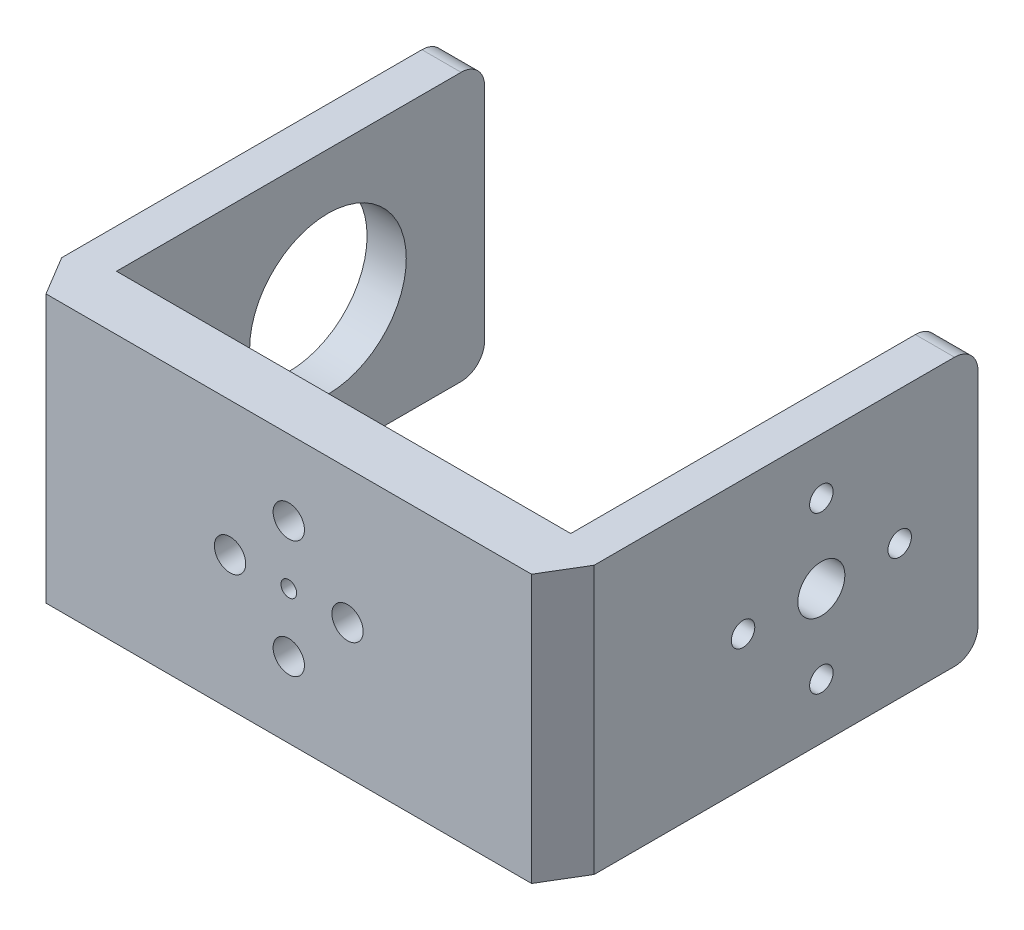
ISO-10303-21;
HEADER;
FILE_DESCRIPTION(('STEP AP214'),'2;1');
FILE_NAME('part.step','',(''),(''),'','','');
FILE_SCHEMA(('AUTOMOTIVE_DESIGN { 1 0 10303 214 1 1 1 1 }'));
ENDSEC;
DATA;
#1=APPLICATION_CONTEXT('core data for automotive mechanical design processes');
#2=APPLICATION_PROTOCOL_DEFINITION('international standard','automotive_design',2000,#1);
#3=PRODUCT_CONTEXT('',#1,'mechanical');
#4=PRODUCT('Part','Part','',(#3));
#5=PRODUCT_RELATED_PRODUCT_CATEGORY('part','',(#4));
#6=PRODUCT_DEFINITION_FORMATION('','',#4);
#7=PRODUCT_DEFINITION_CONTEXT('part definition',#1,'design');
#8=PRODUCT_DEFINITION('design','',#6,#7);
#9=PRODUCT_DEFINITION_SHAPE('','',#8);
#10=(LENGTH_UNIT() NAMED_UNIT(*) SI_UNIT(.MILLI.,.METRE.));
#11=(NAMED_UNIT(*) PLANE_ANGLE_UNIT() SI_UNIT($,.RADIAN.));
#12=(NAMED_UNIT(*) SI_UNIT($,.STERADIAN.) SOLID_ANGLE_UNIT());
#13=UNCERTAINTY_MEASURE_WITH_UNIT(LENGTH_MEASURE(1.E-05),#10,'distance_accuracy_value','');
#14=(GEOMETRIC_REPRESENTATION_CONTEXT(3) GLOBAL_UNCERTAINTY_ASSIGNED_CONTEXT((#13)) GLOBAL_UNIT_ASSIGNED_CONTEXT((#10,
#11,#12)) REPRESENTATION_CONTEXT('',''));
#15=CARTESIAN_POINT('',(0.,0.,0.));
#16=DIRECTION('',(0.,0.,1.));
#17=DIRECTION('',(1.,0.,0.));
#18=AXIS2_PLACEMENT_3D('',#15,#16,#17);
#19=CARTESIAN_POINT('',(0.,34.2,0.));
#20=DIRECTION('',(-1.,0.,0.));
#21=DIRECTION('',(0.,0.,1.));
#22=AXIS2_PLACEMENT_3D('',#19,#20,#21);
#23=PLANE('',#22);
#24=CARTESIAN_POINT('',(0.,17.1,-27.));
#25=DIRECTION('',(-1.,0.,0.));
#26=DIRECTION('',(0.,0.,1.));
#27=AXIS2_PLACEMENT_3D('',#24,#25,#26);
#28=CIRCLE('',#27,10.);
#29=CARTESIAN_POINT('',(0.,17.1,-17.));
#30=VERTEX_POINT('',#29);
#31=EDGE_CURVE('E349',#30,#30,#28,.F.);
#32=ORIENTED_EDGE('',*,*,#31,.F.);
#33=EDGE_LOOP('',(#32));
#34=FACE_BOUND('',#33,.T.);
#35=DIRECTION('',(0.,0.,-1.));
#36=VECTOR('',#35,1.);
#37=CARTESIAN_POINT('',(0.,0.,0.));
#38=LINE('',#37,#36);
#39=CARTESIAN_POINT('',(0.,0.,0.));
#40=VERTEX_POINT('',#39);
#41=CARTESIAN_POINT('',(0.,0.,-44.));
#42=VERTEX_POINT('',#41);
#43=EDGE_CURVE('E191',#40,#42,#38,.T.);
#44=ORIENTED_EDGE('',*,*,#43,.T.);
#45=CARTESIAN_POINT('',(0.,3.,-44.));
#46=DIRECTION('',(-1.,0.,0.));
#47=DIRECTION('',(0.,0.,1.));
#48=AXIS2_PLACEMENT_3D('',#45,#46,#47);
#49=CIRCLE('',#48,3.);
#50=CARTESIAN_POINT('',(0.,3.,-47.));
#51=VERTEX_POINT('',#50);
#52=EDGE_CURVE('E268',#42,#51,#49,.F.);
#53=ORIENTED_EDGE('',*,*,#52,.T.);
#54=DIRECTION('',(0.,-1.,0.));
#55=VECTOR('',#54,1.);
#56=CARTESIAN_POINT('',(0.,34.2,-47.));
#57=LINE('',#56,#55);
#58=CARTESIAN_POINT('',(0.,31.2,-47.));
#59=VERTEX_POINT('',#58);
#60=EDGE_CURVE('E242',#59,#51,#57,.T.);
#61=ORIENTED_EDGE('',*,*,#60,.F.);
#62=CARTESIAN_POINT('',(0.,31.2,-44.));
#63=DIRECTION('',(-1.,0.,0.));
#64=DIRECTION('',(0.,0.,1.));
#65=AXIS2_PLACEMENT_3D('',#62,#63,#64);
#66=CIRCLE('',#65,3.);
#67=CARTESIAN_POINT('',(0.,34.2,-44.));
#68=VERTEX_POINT('',#67);
#69=EDGE_CURVE('E265',#59,#68,#66,.F.);
#70=ORIENTED_EDGE('',*,*,#69,.T.);
#71=DIRECTION('',(0.,0.,-1.));
#72=VECTOR('',#71,1.);
#73=CARTESIAN_POINT('',(0.,34.2,0.));
#74=LINE('',#73,#72);
#75=CARTESIAN_POINT('',(0.,34.2,0.));
#76=VERTEX_POINT('',#75);
#77=EDGE_CURVE('E152',#76,#68,#74,.T.);
#78=ORIENTED_EDGE('',*,*,#77,.F.);
#79=DIRECTION('',(0.,-1.,0.));
#80=VECTOR('',#79,1.);
#81=CARTESIAN_POINT('',(0.,34.2,0.));
#82=LINE('',#81,#80);
#83=EDGE_CURVE('E190',#76,#40,#82,.T.);
#84=ORIENTED_EDGE('',*,*,#83,.T.);
#85=EDGE_LOOP('',(#44,#53,#61,#70,#78,#84));
#86=FACE_BOUND('',#85,.T.);
#87=ADVANCED_FACE('F39',(#34,#86),#23,.F.);
#88=CARTESIAN_POINT('',(0.,34.2,-47.));
#89=DIRECTION('',(0.,0.,1.));
#90=DIRECTION('',(1.,0.,0.));
#91=AXIS2_PLACEMENT_3D('',#88,#89,#90);
#92=PLANE('',#91);
#93=ORIENTED_EDGE('',*,*,#60,.T.);
#94=DIRECTION('',(-1.,0.,0.));
#95=VECTOR('',#94,1.);
#96=CARTESIAN_POINT('',(0.,3.,-47.));
#97=LINE('',#96,#95);
#98=CARTESIAN_POINT('',(-5.,3.,-47.));
#99=VERTEX_POINT('',#98);
#100=EDGE_CURVE('E249',#51,#99,#97,.T.);
#101=ORIENTED_EDGE('',*,*,#100,.T.);
#102=DIRECTION('',(0.,-1.,0.));
#103=VECTOR('',#102,1.);
#104=CARTESIAN_POINT('',(-5.,34.2,-47.));
#105=LINE('',#104,#103);
#106=CARTESIAN_POINT('',(-5.,31.2,-47.));
#107=VERTEX_POINT('',#106);
#108=EDGE_CURVE('E164',#107,#99,#105,.T.);
#109=ORIENTED_EDGE('',*,*,#108,.F.);
#110=DIRECTION('',(-1.,0.,0.));
#111=VECTOR('',#110,1.);
#112=CARTESIAN_POINT('',(0.,31.2,-47.));
#113=LINE('',#112,#111);
#114=EDGE_CURVE('E246',#107,#59,#113,.F.);
#115=ORIENTED_EDGE('',*,*,#114,.T.);
#116=EDGE_LOOP('',(#93,#101,#109,#115));
#117=FACE_BOUND('',#116,.T.);
#118=ADVANCED_FACE('F441',(#117),#92,.F.);
#119=CARTESIAN_POINT('',(-5.,34.2,-47.));
#120=DIRECTION('',(1.,0.,0.));
#121=DIRECTION('',(0.,0.,-1.));
#122=AXIS2_PLACEMENT_3D('',#119,#120,#121);
#123=PLANE('',#122);
#124=CARTESIAN_POINT('',(-5.,17.1,-27.));
#125=DIRECTION('',(-1.,0.,0.));
#126=DIRECTION('',(0.,0.,1.));
#127=AXIS2_PLACEMENT_3D('',#124,#125,#126);
#128=CIRCLE('',#127,10.);
#129=CARTESIAN_POINT('',(-5.,17.1,-17.));
#130=VERTEX_POINT('',#129);
#131=EDGE_CURVE('E365',#130,#130,#128,.T.);
#132=ORIENTED_EDGE('',*,*,#131,.F.);
#133=EDGE_LOOP('',(#132));
#134=FACE_BOUND('',#133,.T.);
#135=ORIENTED_EDGE('',*,*,#108,.T.);
#136=CARTESIAN_POINT('',(-5.,3.,-44.));
#137=DIRECTION('',(1.,0.,0.));
#138=DIRECTION('',(0.,0.,-1.));
#139=AXIS2_PLACEMENT_3D('',#136,#137,#138);
#140=CIRCLE('',#139,3.);
#141=CARTESIAN_POINT('',(-5.,0.,-44.));
#142=VERTEX_POINT('',#141);
#143=EDGE_CURVE('E256',#99,#142,#140,.F.);
#144=ORIENTED_EDGE('',*,*,#143,.T.);
#145=DIRECTION('',(0.,0.,1.));
#146=VECTOR('',#145,1.);
#147=CARTESIAN_POINT('',(-5.,0.,-47.));
#148=LINE('',#147,#146);
#149=CARTESIAN_POINT('',(-5.,0.,2.));
#150=VERTEX_POINT('',#149);
#151=EDGE_CURVE('E159',#142,#150,#148,.T.);
#152=ORIENTED_EDGE('',*,*,#151,.T.);
#153=DIRECTION('',(0.,-1.,0.));
#154=VECTOR('',#153,1.);
#155=CARTESIAN_POINT('',(-5.,34.2,2.));
#156=LINE('',#155,#154);
#157=CARTESIAN_POINT('',(-5.,34.2,2.));
#158=VERTEX_POINT('',#157);
#159=EDGE_CURVE('E155',#158,#150,#156,.T.);
#160=ORIENTED_EDGE('',*,*,#159,.F.);
#161=DIRECTION('',(0.,0.,1.));
#162=VECTOR('',#161,1.);
#163=CARTESIAN_POINT('',(-5.,34.2,-47.));
#164=LINE('',#163,#162);
#165=CARTESIAN_POINT('',(-5.,34.2,-44.));
#166=VERTEX_POINT('',#165);
#167=EDGE_CURVE('E141',#166,#158,#164,.T.);
#168=ORIENTED_EDGE('',*,*,#167,.F.);
#169=CARTESIAN_POINT('',(-5.,31.2,-44.));
#170=DIRECTION('',(1.,0.,0.));
#171=DIRECTION('',(0.,0.,-1.));
#172=AXIS2_PLACEMENT_3D('',#169,#170,#171);
#173=CIRCLE('',#172,3.);
#174=EDGE_CURVE('E253',#166,#107,#173,.F.);
#175=ORIENTED_EDGE('',*,*,#174,.T.);
#176=EDGE_LOOP('',(#135,#144,#152,#160,#168,#175));
#177=FACE_BOUND('',#176,.T.);
#178=ADVANCED_FACE('F157',(#134,#177),#123,.F.);
#179=CARTESIAN_POINT('',(-5.,34.2,2.));
#180=DIRECTION('',(0.857492925712544,0.,-0.514495755427527));
#181=DIRECTION('',(-0.514495755427527,0.,-0.857492925712544));
#182=AXIS2_PLACEMENT_3D('',#179,#180,#181);
#183=PLANE('',#182);
#184=DIRECTION('',(0.514495755427527,0.,0.857492925712544));
#185=VECTOR('',#184,1.);
#186=CARTESIAN_POINT('',(-5.,0.,2.));
#187=LINE('',#186,#185);
#188=CARTESIAN_POINT('',(-2.,0.,7.));
#189=VERTEX_POINT('',#188);
#190=EDGE_CURVE('E198',#150,#189,#187,.T.);
#191=ORIENTED_EDGE('',*,*,#190,.T.);
#192=DIRECTION('',(0.,-1.,0.));
#193=VECTOR('',#192,1.);
#194=CARTESIAN_POINT('',(-2.,34.2,7.));
#195=LINE('',#194,#193);
#196=CARTESIAN_POINT('',(-2.,34.2,7.));
#197=VERTEX_POINT('',#196);
#198=EDGE_CURVE('E165',#197,#189,#195,.T.);
#199=ORIENTED_EDGE('',*,*,#198,.F.);
#200=DIRECTION('',(0.514495755427527,0.,0.857492925712544));
#201=VECTOR('',#200,1.);
#202=CARTESIAN_POINT('',(-5.,34.2,2.));
#203=LINE('',#202,#201);
#204=EDGE_CURVE('E146',#158,#197,#203,.T.);
#205=ORIENTED_EDGE('',*,*,#204,.F.);
#206=ORIENTED_EDGE('',*,*,#159,.T.);
#207=EDGE_LOOP('',(#191,#199,#205,#206));
#208=FACE_BOUND('',#207,.T.);
#209=ADVANCED_FACE('F167',(#208),#183,.F.);
#210=CARTESIAN_POINT('',(58.,34.2,7.));
#211=DIRECTION('',(0.,0.,-1.));
#212=DIRECTION('',(-1.,0.,0.));
#213=AXIS2_PLACEMENT_3D('',#210,#211,#212);
#214=PLANE('',#213);
#215=CARTESIAN_POINT('',(21.5,17.1,7.));
#216=DIRECTION('',(0.,0.,-1.));
#217=DIRECTION('',(-1.,0.,0.));
#218=AXIS2_PLACEMENT_3D('',#215,#216,#217);
#219=CIRCLE('',#218,2.00000000000001);
#220=CARTESIAN_POINT('',(19.5,17.1,7.));
#221=VERTEX_POINT('',#220);
#222=EDGE_CURVE('E195',#221,#221,#219,.F.);
#223=ORIENTED_EDGE('',*,*,#222,.F.);
#224=EDGE_LOOP('',(#223));
#225=FACE_BOUND('',#224,.T.);
#226=CARTESIAN_POINT('',(29.,17.1,7.));
#227=DIRECTION('',(0.,0.,-1.));
#228=DIRECTION('',(-1.,0.,0.));
#229=AXIS2_PLACEMENT_3D('',#226,#227,#228);
#230=CIRCLE('',#229,0.999999999999998);
#231=CARTESIAN_POINT('',(28.,17.1,7.));
#232=VERTEX_POINT('',#231);
#233=EDGE_CURVE('E345',#232,#232,#230,.F.);
#234=ORIENTED_EDGE('',*,*,#233,.F.);
#235=EDGE_LOOP('',(#234));
#236=FACE_BOUND('',#235,.T.);
#237=CARTESIAN_POINT('',(29.,24.6,7.));
#238=DIRECTION('',(0.,0.,-1.));
#239=DIRECTION('',(-1.,0.,0.));
#240=AXIS2_PLACEMENT_3D('',#237,#238,#239);
#241=CIRCLE('',#240,2.00000000000001);
#242=CARTESIAN_POINT('',(27.,24.6,7.));
#243=VERTEX_POINT('',#242);
#244=EDGE_CURVE('E344',#243,#243,#241,.F.);
#245=ORIENTED_EDGE('',*,*,#244,.F.);
#246=EDGE_LOOP('',(#245));
#247=FACE_BOUND('',#246,.T.);
#248=CARTESIAN_POINT('',(36.5,17.1,7.));
#249=DIRECTION('',(0.,0.,-1.));
#250=DIRECTION('',(-1.,0.,0.));
#251=AXIS2_PLACEMENT_3D('',#248,#249,#250);
#252=CIRCLE('',#251,2.);
#253=CARTESIAN_POINT('',(34.5,17.1,7.));
#254=VERTEX_POINT('',#253);
#255=EDGE_CURVE('E327',#254,#254,#252,.F.);
#256=ORIENTED_EDGE('',*,*,#255,.F.);
#257=EDGE_LOOP('',(#256));
#258=FACE_BOUND('',#257,.T.);
#259=CARTESIAN_POINT('',(29.,9.6,7.));
#260=DIRECTION('',(0.,0.,-1.));
#261=DIRECTION('',(-1.,0.,0.));
#262=AXIS2_PLACEMENT_3D('',#259,#260,#261);
#263=CIRCLE('',#262,2.);
#264=CARTESIAN_POINT('',(27.,9.6,7.));
#265=VERTEX_POINT('',#264);
#266=EDGE_CURVE('E326',#265,#265,#263,.F.);
#267=ORIENTED_EDGE('',*,*,#266,.F.);
#268=EDGE_LOOP('',(#267));
#269=FACE_BOUND('',#268,.T.);
#270=DIRECTION('',(1.,0.,0.));
#271=VECTOR('',#270,1.);
#272=CARTESIAN_POINT('',(58.,0.,7.));
#273=LINE('',#272,#271);
#274=CARTESIAN_POINT('',(60.,0.,7.));
#275=VERTEX_POINT('',#274);
#276=EDGE_CURVE('E201',#189,#275,#273,.T.);
#277=ORIENTED_EDGE('',*,*,#276,.T.);
#278=DIRECTION('',(0.,-1.,0.));
#279=VECTOR('',#278,1.);
#280=CARTESIAN_POINT('',(60.,34.2,7.));
#281=LINE('',#280,#279);
#282=CARTESIAN_POINT('',(60.,34.2,7.));
#283=VERTEX_POINT('',#282);
#284=EDGE_CURVE('E234',#283,#275,#281,.T.);
#285=ORIENTED_EDGE('',*,*,#284,.F.);
#286=DIRECTION('',(1.,0.,0.));
#287=VECTOR('',#286,1.);
#288=CARTESIAN_POINT('',(0.,34.2,7.));
#289=LINE('',#288,#287);
#290=EDGE_CURVE('E171',#197,#283,#289,.T.);
#291=ORIENTED_EDGE('',*,*,#290,.F.);
#292=ORIENTED_EDGE('',*,*,#198,.T.);
#293=EDGE_LOOP('',(#277,#285,#291,#292));
#294=FACE_BOUND('',#293,.T.);
#295=ADVANCED_FACE('F654',(#225,#236,#247,#258,#269,#294),#214,.F.);
#296=CARTESIAN_POINT('',(63.,34.2,2.));
#297=DIRECTION('',(-0.857492925712543,0.,-0.514495755427528));
#298=DIRECTION('',(-0.514495755427528,0.,0.857492925712543));
#299=AXIS2_PLACEMENT_3D('',#296,#297,#298);
#300=PLANE('',#299);
#301=DIRECTION('',(0.514495755427528,0.,-0.857492925712543));
#302=VECTOR('',#301,1.);
#303=CARTESIAN_POINT('',(63.,0.,2.));
#304=LINE('',#303,#302);
#305=CARTESIAN_POINT('',(63.,0.,2.));
#306=VERTEX_POINT('',#305);
#307=EDGE_CURVE('E204',#275,#306,#304,.T.);
#308=ORIENTED_EDGE('',*,*,#307,.T.);
#309=DIRECTION('',(0.,-1.,0.));
#310=VECTOR('',#309,1.);
#311=CARTESIAN_POINT('',(63.,34.2,2.));
#312=LINE('',#311,#310);
#313=CARTESIAN_POINT('',(63.,34.2,2.));
#314=VERTEX_POINT('',#313);
#315=EDGE_CURVE('E230',#314,#306,#312,.T.);
#316=ORIENTED_EDGE('',*,*,#315,.F.);
#317=DIRECTION('',(0.514495755427528,0.,-0.857492925712543));
#318=VECTOR('',#317,1.);
#319=CARTESIAN_POINT('',(63.,34.2,2.));
#320=LINE('',#319,#318);
#321=EDGE_CURVE('E174',#283,#314,#320,.T.);
#322=ORIENTED_EDGE('',*,*,#321,.F.);
#323=ORIENTED_EDGE('',*,*,#284,.T.);
#324=EDGE_LOOP('',(#308,#316,#322,#323));
#325=FACE_BOUND('',#324,.T.);
#326=ADVANCED_FACE('F414',(#325),#300,.F.);
#327=CARTESIAN_POINT('',(63.,34.2,-47.));
#328=DIRECTION('',(-1.,0.,0.));
#329=DIRECTION('',(0.,0.,1.));
#330=AXIS2_PLACEMENT_3D('',#327,#328,#329);
#331=PLANE('',#330);
#332=CARTESIAN_POINT('',(63.,27.1,-27.));
#333=DIRECTION('',(1.,0.,0.));
#334=DIRECTION('',(0.,0.,-1.));
#335=AXIS2_PLACEMENT_3D('',#332,#333,#334);
#336=CIRCLE('',#335,1.5);
#337=CARTESIAN_POINT('',(63.,27.1,-28.5));
#338=VERTEX_POINT('',#337);
#339=EDGE_CURVE('E384',#338,#338,#336,.T.);
#340=ORIENTED_EDGE('',*,*,#339,.F.);
#341=EDGE_LOOP('',(#340));
#342=FACE_BOUND('',#341,.T.);
#343=CARTESIAN_POINT('',(63.,17.1,-17.));
#344=DIRECTION('',(1.,0.,0.));
#345=DIRECTION('',(0.,0.,-1.));
#346=AXIS2_PLACEMENT_3D('',#343,#344,#345);
#347=CIRCLE('',#346,1.5);
#348=CARTESIAN_POINT('',(63.,17.1,-18.5));
#349=VERTEX_POINT('',#348);
#350=EDGE_CURVE('E388',#349,#349,#347,.T.);
#351=ORIENTED_EDGE('',*,*,#350,.F.);
#352=EDGE_LOOP('',(#351));
#353=FACE_BOUND('',#352,.T.);
#354=CARTESIAN_POINT('',(63.,7.1,-27.));
#355=DIRECTION('',(1.,0.,0.));
#356=DIRECTION('',(0.,0.,-1.));
#357=AXIS2_PLACEMENT_3D('',#354,#355,#356);
#358=CIRCLE('',#357,1.5);
#359=CARTESIAN_POINT('',(63.,7.1,-28.5));
#360=VERTEX_POINT('',#359);
#361=EDGE_CURVE('E379',#360,#360,#358,.T.);
#362=ORIENTED_EDGE('',*,*,#361,.F.);
#363=EDGE_LOOP('',(#362));
#364=FACE_BOUND('',#363,.T.);
#365=CARTESIAN_POINT('',(63.,17.1,-27.));
#366=DIRECTION('',(1.,0.,0.));
#367=DIRECTION('',(0.,0.,-1.));
#368=AXIS2_PLACEMENT_3D('',#365,#366,#367);
#369=CIRCLE('',#368,3.);
#370=CARTESIAN_POINT('',(63.,17.1,-30.));
#371=VERTEX_POINT('',#370);
#372=EDGE_CURVE('E370',#371,#371,#369,.T.);
#373=ORIENTED_EDGE('',*,*,#372,.F.);
#374=EDGE_LOOP('',(#373));
#375=FACE_BOUND('',#374,.T.);
#376=CARTESIAN_POINT('',(63.,17.1,-37.));
#377=DIRECTION('',(1.,0.,0.));
#378=DIRECTION('',(0.,0.,-1.));
#379=AXIS2_PLACEMENT_3D('',#376,#377,#378);
#380=CIRCLE('',#379,1.5);
#381=CARTESIAN_POINT('',(63.,17.1,-38.5));
#382=VERTEX_POINT('',#381);
#383=EDGE_CURVE('E380',#382,#382,#380,.T.);
#384=ORIENTED_EDGE('',*,*,#383,.F.);
#385=EDGE_LOOP('',(#384));
#386=FACE_BOUND('',#385,.T.);
#387=DIRECTION('',(0.,0.,-1.));
#388=VECTOR('',#387,1.);
#389=CARTESIAN_POINT('',(63.,0.,-47.));
#390=LINE('',#389,#388);
#391=CARTESIAN_POINT('',(63.,0.,-44.));
#392=VERTEX_POINT('',#391);
#393=EDGE_CURVE('E207',#306,#392,#390,.T.);
#394=ORIENTED_EDGE('',*,*,#393,.T.);
#395=CARTESIAN_POINT('',(63.,3.,-44.));
#396=DIRECTION('',(-1.,0.,0.));
#397=DIRECTION('',(0.,0.,1.));
#398=AXIS2_PLACEMENT_3D('',#395,#396,#397);
#399=CIRCLE('',#398,3.);
#400=CARTESIAN_POINT('',(63.,3.,-47.));
#401=VERTEX_POINT('',#400);
#402=EDGE_CURVE('E11',#392,#401,#399,.F.);
#403=ORIENTED_EDGE('',*,*,#402,.T.);
#404=DIRECTION('',(0.,-1.,0.));
#405=VECTOR('',#404,1.);
#406=CARTESIAN_POINT('',(63.,34.2,-47.));
#407=LINE('',#406,#405);
#408=CARTESIAN_POINT('',(63.,31.2,-47.));
#409=VERTEX_POINT('',#408);
#410=EDGE_CURVE('E227',#409,#401,#407,.T.);
#411=ORIENTED_EDGE('',*,*,#410,.F.);
#412=CARTESIAN_POINT('',(63.,31.2,-44.));
#413=DIRECTION('',(-1.,0.,0.));
#414=DIRECTION('',(0.,0.,1.));
#415=AXIS2_PLACEMENT_3D('',#412,#413,#414);
#416=CIRCLE('',#415,3.);
#417=CARTESIAN_POINT('',(63.,34.2,-44.));
#418=VERTEX_POINT('',#417);
#419=EDGE_CURVE('E48',#409,#418,#416,.F.);
#420=ORIENTED_EDGE('',*,*,#419,.T.);
#421=DIRECTION('',(0.,0.,-1.));
#422=VECTOR('',#421,1.);
#423=CARTESIAN_POINT('',(63.,34.2,-47.));
#424=LINE('',#423,#422);
#425=EDGE_CURVE('E180',#314,#418,#424,.T.);
#426=ORIENTED_EDGE('',*,*,#425,.F.);
#427=ORIENTED_EDGE('',*,*,#315,.T.);
#428=EDGE_LOOP('',(#394,#403,#411,#420,#426,#427));
#429=FACE_BOUND('',#428,.T.);
#430=ADVANCED_FACE('F291',(#342,#353,#364,#375,#386,#429),#331,.F.);
#431=CARTESIAN_POINT('',(58.,34.2,-47.));
#432=DIRECTION('',(0.,0.,1.));
#433=DIRECTION('',(1.,0.,0.));
#434=AXIS2_PLACEMENT_3D('',#431,#432,#433);
#435=PLANE('',#434);
#436=ORIENTED_EDGE('',*,*,#410,.T.);
#437=DIRECTION('',(-1.,0.,0.));
#438=VECTOR('',#437,1.);
#439=CARTESIAN_POINT('',(58.,3.,-47.));
#440=LINE('',#439,#438);
#441=CARTESIAN_POINT('',(58.,3.,-47.));
#442=VERTEX_POINT('',#441);
#443=EDGE_CURVE('E279',#401,#442,#440,.T.);
#444=ORIENTED_EDGE('',*,*,#443,.T.);
#445=DIRECTION('',(0.,-1.,0.));
#446=VECTOR('',#445,1.);
#447=CARTESIAN_POINT('',(58.,34.2,-47.));
#448=LINE('',#447,#446);
#449=CARTESIAN_POINT('',(58.,31.2,-47.));
#450=VERTEX_POINT('',#449);
#451=EDGE_CURVE('E223',#450,#442,#448,.T.);
#452=ORIENTED_EDGE('',*,*,#451,.F.);
#453=DIRECTION('',(-1.,0.,0.));
#454=VECTOR('',#453,1.);
#455=CARTESIAN_POINT('',(63.,31.2,-47.));
#456=LINE('',#455,#454);
#457=EDGE_CURVE('E60',#450,#409,#456,.F.);
#458=ORIENTED_EDGE('',*,*,#457,.T.);
#459=EDGE_LOOP('',(#436,#444,#452,#458));
#460=FACE_BOUND('',#459,.T.);
#461=ADVANCED_FACE('F300',(#460),#435,.F.);
#462=CARTESIAN_POINT('',(58.,34.2,0.));
#463=DIRECTION('',(1.,0.,0.));
#464=DIRECTION('',(0.,0.,-1.));
#465=AXIS2_PLACEMENT_3D('',#462,#463,#464);
#466=PLANE('',#465);
#467=CARTESIAN_POINT('',(58.,27.1,-27.));
#468=DIRECTION('',(1.,0.,0.));
#469=DIRECTION('',(0.,0.,-1.));
#470=AXIS2_PLACEMENT_3D('',#467,#468,#469);
#471=CIRCLE('',#470,1.5);
#472=CARTESIAN_POINT('',(58.,27.1,-28.5));
#473=VERTEX_POINT('',#472);
#474=EDGE_CURVE('E369',#473,#473,#471,.F.);
#475=ORIENTED_EDGE('',*,*,#474,.F.);
#476=EDGE_LOOP('',(#475));
#477=FACE_BOUND('',#476,.T.);
#478=CARTESIAN_POINT('',(58.,17.1,-17.));
#479=DIRECTION('',(1.,0.,0.));
#480=DIRECTION('',(0.,0.,-1.));
#481=AXIS2_PLACEMENT_3D('',#478,#479,#480);
#482=CIRCLE('',#481,1.5);
#483=CARTESIAN_POINT('',(58.,17.1,-18.5));
#484=VERTEX_POINT('',#483);
#485=EDGE_CURVE('E393',#484,#484,#482,.F.);
#486=ORIENTED_EDGE('',*,*,#485,.F.);
#487=EDGE_LOOP('',(#486));
#488=FACE_BOUND('',#487,.T.);
#489=CARTESIAN_POINT('',(58.,7.1,-27.));
#490=DIRECTION('',(1.,0.,0.));
#491=DIRECTION('',(0.,0.,-1.));
#492=AXIS2_PLACEMENT_3D('',#489,#490,#491);
#493=CIRCLE('',#492,1.5);
#494=CARTESIAN_POINT('',(58.,7.1,-28.5));
#495=VERTEX_POINT('',#494);
#496=EDGE_CURVE('E392',#495,#495,#493,.F.);
#497=ORIENTED_EDGE('',*,*,#496,.F.);
#498=EDGE_LOOP('',(#497));
#499=FACE_BOUND('',#498,.T.);
#500=CARTESIAN_POINT('',(58.,17.1,-27.));
#501=DIRECTION('',(1.,0.,0.));
#502=DIRECTION('',(0.,0.,-1.));
#503=AXIS2_PLACEMENT_3D('',#500,#501,#502);
#504=CIRCLE('',#503,3.);
#505=CARTESIAN_POINT('',(58.,17.1,-30.));
#506=VERTEX_POINT('',#505);
#507=EDGE_CURVE('E375',#506,#506,#504,.F.);
#508=ORIENTED_EDGE('',*,*,#507,.F.);
#509=EDGE_LOOP('',(#508));
#510=FACE_BOUND('',#509,.T.);
#511=CARTESIAN_POINT('',(58.,17.1,-37.));
#512=DIRECTION('',(1.,0.,0.));
#513=DIRECTION('',(0.,0.,-1.));
#514=AXIS2_PLACEMENT_3D('',#511,#512,#513);
#515=CIRCLE('',#514,1.5);
#516=CARTESIAN_POINT('',(58.,17.1,-38.5));
#517=VERTEX_POINT('',#516);
#518=EDGE_CURVE('E374',#517,#517,#515,.F.);
#519=ORIENTED_EDGE('',*,*,#518,.F.);
#520=EDGE_LOOP('',(#519));
#521=FACE_BOUND('',#520,.T.);
#522=ORIENTED_EDGE('',*,*,#451,.T.);
#523=CARTESIAN_POINT('',(58.,3.,-44.));
#524=DIRECTION('',(1.,0.,0.));
#525=DIRECTION('',(0.,0.,-1.));
#526=AXIS2_PLACEMENT_3D('',#523,#524,#525);
#527=CIRCLE('',#526,3.);
#528=CARTESIAN_POINT('',(58.,0.,-44.));
#529=VERTEX_POINT('',#528);
#530=EDGE_CURVE('E286',#442,#529,#527,.F.);
#531=ORIENTED_EDGE('',*,*,#530,.T.);
#532=DIRECTION('',(0.,0.,1.));
#533=VECTOR('',#532,1.);
#534=CARTESIAN_POINT('',(58.,0.,0.));
#535=LINE('',#534,#533);
#536=CARTESIAN_POINT('',(58.,0.,0.));
#537=VERTEX_POINT('',#536);
#538=EDGE_CURVE('E210',#529,#537,#535,.T.);
#539=ORIENTED_EDGE('',*,*,#538,.T.);
#540=DIRECTION('',(0.,-1.,0.));
#541=VECTOR('',#540,1.);
#542=CARTESIAN_POINT('',(58.,34.2,0.));
#543=LINE('',#542,#541);
#544=CARTESIAN_POINT('',(58.,34.2,0.));
#545=VERTEX_POINT('',#544);
#546=EDGE_CURVE('E219',#545,#537,#543,.T.);
#547=ORIENTED_EDGE('',*,*,#546,.F.);
#548=DIRECTION('',(0.,0.,1.));
#549=VECTOR('',#548,1.);
#550=CARTESIAN_POINT('',(58.,34.2,0.));
#551=LINE('',#550,#549);
#552=CARTESIAN_POINT('',(58.,34.2,-44.));
#553=VERTEX_POINT('',#552);
#554=EDGE_CURVE('E184',#553,#545,#551,.T.);
#555=ORIENTED_EDGE('',*,*,#554,.F.);
#556=CARTESIAN_POINT('',(58.,31.2,-44.));
#557=DIRECTION('',(1.,0.,0.));
#558=DIRECTION('',(0.,0.,-1.));
#559=AXIS2_PLACEMENT_3D('',#556,#557,#558);
#560=CIRCLE('',#559,3.);
#561=EDGE_CURVE('E283',#553,#450,#560,.F.);
#562=ORIENTED_EDGE('',*,*,#561,.T.);
#563=EDGE_LOOP('',(#522,#531,#539,#547,#555,#562));
#564=FACE_BOUND('',#563,.T.);
#565=ADVANCED_FACE('F298',(#477,#488,#499,#510,#521,#564),#466,.F.);
#566=CARTESIAN_POINT('',(0.,34.2,0.));
#567=DIRECTION('',(0.,0.,1.));
#568=DIRECTION('',(1.,0.,0.));
#569=AXIS2_PLACEMENT_3D('',#566,#567,#568);
#570=PLANE('',#569);
#571=CARTESIAN_POINT('',(21.5,17.1,0.));
#572=DIRECTION('',(0.,0.,-1.));
#573=DIRECTION('',(-1.,0.,0.));
#574=AXIS2_PLACEMENT_3D('',#571,#572,#573);
#575=CIRCLE('',#574,2.00000000000001);
#576=CARTESIAN_POINT('',(19.5,17.1,0.));
#577=VERTEX_POINT('',#576);
#578=EDGE_CURVE('E336',#577,#577,#575,.T.);
#579=ORIENTED_EDGE('',*,*,#578,.F.);
#580=EDGE_LOOP('',(#579));
#581=FACE_BOUND('',#580,.T.);
#582=CARTESIAN_POINT('',(29.,17.1,0.));
#583=DIRECTION('',(0.,0.,-1.));
#584=DIRECTION('',(-1.,0.,0.));
#585=AXIS2_PLACEMENT_3D('',#582,#583,#584);
#586=CIRCLE('',#585,0.999999999999998);
#587=CARTESIAN_POINT('',(28.,17.1,0.));
#588=VERTEX_POINT('',#587);
#589=EDGE_CURVE('E340',#588,#588,#586,.T.);
#590=ORIENTED_EDGE('',*,*,#589,.F.);
#591=EDGE_LOOP('',(#590));
#592=FACE_BOUND('',#591,.T.);
#593=CARTESIAN_POINT('',(29.,24.6,0.));
#594=DIRECTION('',(0.,0.,-1.));
#595=DIRECTION('',(-1.,0.,0.));
#596=AXIS2_PLACEMENT_3D('',#593,#594,#595);
#597=CIRCLE('',#596,2.00000000000001);
#598=CARTESIAN_POINT('',(27.,24.6,0.));
#599=VERTEX_POINT('',#598);
#600=EDGE_CURVE('E331',#599,#599,#597,.T.);
#601=ORIENTED_EDGE('',*,*,#600,.F.);
#602=EDGE_LOOP('',(#601));
#603=FACE_BOUND('',#602,.T.);
#604=CARTESIAN_POINT('',(36.5,17.1,0.));
#605=DIRECTION('',(0.,0.,-1.));
#606=DIRECTION('',(-1.,0.,0.));
#607=AXIS2_PLACEMENT_3D('',#604,#605,#606);
#608=CIRCLE('',#607,2.);
#609=CARTESIAN_POINT('',(34.5,17.1,0.));
#610=VERTEX_POINT('',#609);
#611=EDGE_CURVE('E322',#610,#610,#608,.T.);
#612=ORIENTED_EDGE('',*,*,#611,.F.);
#613=EDGE_LOOP('',(#612));
#614=FACE_BOUND('',#613,.T.);
#615=CARTESIAN_POINT('',(29.,9.6,0.));
#616=DIRECTION('',(0.,0.,-1.));
#617=DIRECTION('',(-1.,0.,0.));
#618=AXIS2_PLACEMENT_3D('',#615,#616,#617);
#619=CIRCLE('',#618,2.);
#620=CARTESIAN_POINT('',(27.,9.6,0.));
#621=VERTEX_POINT('',#620);
#622=EDGE_CURVE('E332',#621,#621,#619,.T.);
#623=ORIENTED_EDGE('',*,*,#622,.F.);
#624=EDGE_LOOP('',(#623));
#625=FACE_BOUND('',#624,.T.);
#626=DIRECTION('',(-1.,0.,0.));
#627=VECTOR('',#626,1.);
#628=CARTESIAN_POINT('',(0.,0.,0.));
#629=LINE('',#628,#627);
#630=EDGE_CURVE('E213',#537,#40,#629,.T.);
#631=ORIENTED_EDGE('',*,*,#630,.T.);
#632=ORIENTED_EDGE('',*,*,#83,.F.);
#633=DIRECTION('',(-1.,0.,0.));
#634=VECTOR('',#633,1.);
#635=CARTESIAN_POINT('',(0.,34.2,0.));
#636=LINE('',#635,#634);
#637=EDGE_CURVE('E187',#545,#76,#636,.T.);
#638=ORIENTED_EDGE('',*,*,#637,.F.);
#639=ORIENTED_EDGE('',*,*,#546,.T.);
#640=EDGE_LOOP('',(#631,#632,#638,#639));
#641=FACE_BOUND('',#640,.T.);
#642=ADVANCED_FACE('F313',(#581,#592,#603,#614,#625,#641),#570,.F.);
#643=CARTESIAN_POINT('',(0.,34.2,0.));
#644=DIRECTION('',(0.,1.,0.));
#645=DIRECTION('',(0.,0.,1.));
#646=AXIS2_PLACEMENT_3D('',#643,#644,#645);
#647=PLANE('',#646);
#648=ORIENTED_EDGE('',*,*,#77,.T.);
#649=DIRECTION('',(-1.,0.,0.));
#650=VECTOR('',#649,1.);
#651=CARTESIAN_POINT('',(-5.,34.2,-44.));
#652=LINE('',#651,#650);
#653=EDGE_CURVE('E149',#68,#166,#652,.T.);
#654=ORIENTED_EDGE('',*,*,#653,.T.);
#655=ORIENTED_EDGE('',*,*,#167,.T.);
#656=ORIENTED_EDGE('',*,*,#204,.T.);
#657=ORIENTED_EDGE('',*,*,#290,.T.);
#658=ORIENTED_EDGE('',*,*,#321,.T.);
#659=ORIENTED_EDGE('',*,*,#425,.T.);
#660=DIRECTION('',(-1.,0.,0.));
#661=VECTOR('',#660,1.);
#662=CARTESIAN_POINT('',(58.,34.2,-44.));
#663=LINE('',#662,#661);
#664=EDGE_CURVE('E271',#418,#553,#663,.T.);
#665=ORIENTED_EDGE('',*,*,#664,.T.);
#666=ORIENTED_EDGE('',*,*,#554,.T.);
#667=ORIENTED_EDGE('',*,*,#637,.T.);
#668=EDGE_LOOP('',(#648,#654,#655,#656,#657,#658,#659,#665,#666,#667));
#669=FACE_BOUND('',#668,.T.);
#670=ADVANCED_FACE('F144',(#669),#647,.T.);
#671=CARTESIAN_POINT('',(0.,0.,0.));
#672=DIRECTION('',(0.,1.,0.));
#673=DIRECTION('',(0.,0.,1.));
#674=AXIS2_PLACEMENT_3D('',#671,#672,#673);
#675=PLANE('',#674);
#676=ORIENTED_EDGE('',*,*,#151,.F.);
#677=DIRECTION('',(-1.,0.,0.));
#678=VECTOR('',#677,1.);
#679=CARTESIAN_POINT('',(0.,0.,-44.));
#680=LINE('',#679,#678);
#681=EDGE_CURVE('E262',#142,#42,#680,.F.);
#682=ORIENTED_EDGE('',*,*,#681,.T.);
#683=ORIENTED_EDGE('',*,*,#43,.F.);
#684=ORIENTED_EDGE('',*,*,#630,.F.);
#685=ORIENTED_EDGE('',*,*,#538,.F.);
#686=DIRECTION('',(-1.,0.,0.));
#687=VECTOR('',#686,1.);
#688=CARTESIAN_POINT('',(0.,0.,-44.));
#689=LINE('',#688,#687);
#690=EDGE_CURVE('E259',#529,#392,#689,.F.);
#691=ORIENTED_EDGE('',*,*,#690,.T.);
#692=ORIENTED_EDGE('',*,*,#393,.F.);
#693=ORIENTED_EDGE('',*,*,#307,.F.);
#694=ORIENTED_EDGE('',*,*,#276,.F.);
#695=ORIENTED_EDGE('',*,*,#190,.F.);
#696=EDGE_LOOP('',(#676,#682,#683,#684,#685,#691,#692,#693,#694,#695));
#697=FACE_BOUND('',#696,.T.);
#698=ADVANCED_FACE('F308',(#697),#675,.F.);
#699=CARTESIAN_POINT('',(29.,9.6,12.6568542494924));
#700=DIRECTION('',(0.,0.,-1.));
#701=DIRECTION('',(-1.,0.,0.));
#702=AXIS2_PLACEMENT_3D('',#699,#700,#701);
#703=CYLINDRICAL_SURFACE('',#702,2.);
#704=ORIENTED_EDGE('',*,*,#266,.T.);
#705=EDGE_LOOP('',(#704));
#706=FACE_BOUND('',#705,.T.);
#707=ORIENTED_EDGE('',*,*,#622,.T.);
#708=EDGE_LOOP('',(#707));
#709=FACE_BOUND('',#708,.T.);
#710=ADVANCED_FACE('F567',(#706,#709),#703,.F.);
#711=CARTESIAN_POINT('',(36.5,17.1,12.6568542494924));
#712=DIRECTION('',(0.,0.,-1.));
#713=DIRECTION('',(-1.,0.,0.));
#714=AXIS2_PLACEMENT_3D('',#711,#712,#713);
#715=CYLINDRICAL_SURFACE('',#714,2.);
#716=ORIENTED_EDGE('',*,*,#255,.T.);
#717=EDGE_LOOP('',(#716));
#718=FACE_BOUND('',#717,.T.);
#719=ORIENTED_EDGE('',*,*,#611,.T.);
#720=EDGE_LOOP('',(#719));
#721=FACE_BOUND('',#720,.T.);
#722=ADVANCED_FACE('F574',(#718,#721),#715,.F.);
#723=CARTESIAN_POINT('',(29.,24.6,12.6568542494924));
#724=DIRECTION('',(0.,0.,-1.));
#725=DIRECTION('',(-1.,0.,0.));
#726=AXIS2_PLACEMENT_3D('',#723,#724,#725);
#727=CYLINDRICAL_SURFACE('',#726,2.00000000000001);
#728=ORIENTED_EDGE('',*,*,#244,.T.);
#729=EDGE_LOOP('',(#728));
#730=FACE_BOUND('',#729,.T.);
#731=ORIENTED_EDGE('',*,*,#600,.T.);
#732=EDGE_LOOP('',(#731));
#733=FACE_BOUND('',#732,.T.);
#734=ADVANCED_FACE('F582',(#730,#733),#727,.F.);
#735=CARTESIAN_POINT('',(29.,17.1,12.6568542494924));
#736=DIRECTION('',(0.,0.,-1.));
#737=DIRECTION('',(-1.,0.,0.));
#738=AXIS2_PLACEMENT_3D('',#735,#736,#737);
#739=CYLINDRICAL_SURFACE('',#738,0.999999999999998);
#740=ORIENTED_EDGE('',*,*,#233,.T.);
#741=EDGE_LOOP('',(#740));
#742=FACE_BOUND('',#741,.T.);
#743=ORIENTED_EDGE('',*,*,#589,.T.);
#744=EDGE_LOOP('',(#743));
#745=FACE_BOUND('',#744,.T.);
#746=ADVANCED_FACE('F590',(#742,#745),#739,.F.);
#747=CARTESIAN_POINT('',(21.5,17.1,12.6568542494924));
#748=DIRECTION('',(0.,0.,-1.));
#749=DIRECTION('',(-1.,0.,0.));
#750=AXIS2_PLACEMENT_3D('',#747,#748,#749);
#751=CYLINDRICAL_SURFACE('',#750,2.00000000000001);
#752=ORIENTED_EDGE('',*,*,#222,.T.);
#753=EDGE_LOOP('',(#752));
#754=FACE_BOUND('',#753,.T.);
#755=ORIENTED_EDGE('',*,*,#578,.T.);
#756=EDGE_LOOP('',(#755));
#757=FACE_BOUND('',#756,.T.);
#758=ADVANCED_FACE('F456',(#754,#757),#751,.F.);
#759=CARTESIAN_POINT('',(0.,3.,-44.));
#760=DIRECTION('',(-1.,0.,0.));
#761=DIRECTION('',(0.,0.,1.));
#762=AXIS2_PLACEMENT_3D('',#759,#760,#761);
#763=CYLINDRICAL_SURFACE('',#762,3.);
#764=ORIENTED_EDGE('',*,*,#52,.F.);
#765=ORIENTED_EDGE('',*,*,#681,.F.);
#766=ORIENTED_EDGE('',*,*,#143,.F.);
#767=ORIENTED_EDGE('',*,*,#100,.F.);
#768=EDGE_LOOP('',(#764,#765,#766,#767));
#769=FACE_BOUND('',#768,.T.);
#770=ADVANCED_FACE('F452',(#769),#763,.T.);
#771=CARTESIAN_POINT('',(0.,31.2,-44.));
#772=DIRECTION('',(1.,0.,0.));
#773=DIRECTION('',(0.,0.,-1.));
#774=AXIS2_PLACEMENT_3D('',#771,#772,#773);
#775=CYLINDRICAL_SURFACE('',#774,3.);
#776=ORIENTED_EDGE('',*,*,#69,.F.);
#777=ORIENTED_EDGE('',*,*,#114,.F.);
#778=ORIENTED_EDGE('',*,*,#174,.F.);
#779=ORIENTED_EDGE('',*,*,#653,.F.);
#780=EDGE_LOOP('',(#776,#777,#778,#779));
#781=FACE_BOUND('',#780,.T.);
#782=ADVANCED_FACE('F455',(#781),#775,.T.);
#783=CARTESIAN_POINT('',(58.,3.,-44.));
#784=DIRECTION('',(-1.,0.,0.));
#785=DIRECTION('',(0.,0.,1.));
#786=AXIS2_PLACEMENT_3D('',#783,#784,#785);
#787=CYLINDRICAL_SURFACE('',#786,3.);
#788=ORIENTED_EDGE('',*,*,#402,.F.);
#789=ORIENTED_EDGE('',*,*,#690,.F.);
#790=ORIENTED_EDGE('',*,*,#530,.F.);
#791=ORIENTED_EDGE('',*,*,#443,.F.);
#792=EDGE_LOOP('',(#788,#789,#790,#791));
#793=FACE_BOUND('',#792,.T.);
#794=ADVANCED_FACE('F303',(#793),#787,.T.);
#795=CARTESIAN_POINT('',(0.,31.2,-44.));
#796=DIRECTION('',(1.,0.,0.));
#797=DIRECTION('',(0.,0.,-1.));
#798=AXIS2_PLACEMENT_3D('',#795,#796,#797);
#799=CYLINDRICAL_SURFACE('',#798,3.);
#800=ORIENTED_EDGE('',*,*,#419,.F.);
#801=ORIENTED_EDGE('',*,*,#457,.F.);
#802=ORIENTED_EDGE('',*,*,#561,.F.);
#803=ORIENTED_EDGE('',*,*,#664,.F.);
#804=EDGE_LOOP('',(#800,#801,#802,#803));
#805=FACE_BOUND('',#804,.T.);
#806=ADVANCED_FACE('F41',(#805),#799,.T.);
#807=CARTESIAN_POINT('',(28.2842712474619,17.1,-27.));
#808=DIRECTION('',(-1.,0.,0.));
#809=DIRECTION('',(0.,0.,1.));
#810=AXIS2_PLACEMENT_3D('',#807,#808,#809);
#811=CYLINDRICAL_SURFACE('',#810,10.);
#812=ORIENTED_EDGE('',*,*,#31,.T.);
#813=EDGE_LOOP('',(#812));
#814=FACE_BOUND('',#813,.T.);
#815=ORIENTED_EDGE('',*,*,#131,.T.);
#816=EDGE_LOOP('',(#815));
#817=FACE_BOUND('',#816,.T.);
#818=ADVANCED_FACE('F427',(#814,#817),#811,.F.);
#819=CARTESIAN_POINT('',(49.5147186257614,17.1,-37.));
#820=DIRECTION('',(1.,0.,0.));
#821=DIRECTION('',(0.,0.,-1.));
#822=AXIS2_PLACEMENT_3D('',#819,#820,#821);
#823=CYLINDRICAL_SURFACE('',#822,1.5);
#824=ORIENTED_EDGE('',*,*,#518,.T.);
#825=EDGE_LOOP('',(#824));
#826=FACE_BOUND('',#825,.T.);
#827=ORIENTED_EDGE('',*,*,#383,.T.);
#828=EDGE_LOOP('',(#827));
#829=FACE_BOUND('',#828,.T.);
#830=ADVANCED_FACE('F424',(#826,#829),#823,.F.);
#831=CARTESIAN_POINT('',(49.5147186257614,17.1,-27.));
#832=DIRECTION('',(1.,0.,0.));
#833=DIRECTION('',(0.,0.,-1.));
#834=AXIS2_PLACEMENT_3D('',#831,#832,#833);
#835=CYLINDRICAL_SURFACE('',#834,3.);
#836=ORIENTED_EDGE('',*,*,#507,.T.);
#837=EDGE_LOOP('',(#836));
#838=FACE_BOUND('',#837,.T.);
#839=ORIENTED_EDGE('',*,*,#372,.T.);
#840=EDGE_LOOP('',(#839));
#841=FACE_BOUND('',#840,.T.);
#842=ADVANCED_FACE('F426',(#838,#841),#835,.F.);
#843=CARTESIAN_POINT('',(49.5147186257614,7.1,-27.));
#844=DIRECTION('',(1.,0.,0.));
#845=DIRECTION('',(0.,0.,-1.));
#846=AXIS2_PLACEMENT_3D('',#843,#844,#845);
#847=CYLINDRICAL_SURFACE('',#846,1.5);
#848=ORIENTED_EDGE('',*,*,#496,.T.);
#849=EDGE_LOOP('',(#848));
#850=FACE_BOUND('',#849,.T.);
#851=ORIENTED_EDGE('',*,*,#361,.T.);
#852=EDGE_LOOP('',(#851));
#853=FACE_BOUND('',#852,.T.);
#854=ADVANCED_FACE('F434',(#850,#853),#847,.F.);
#855=CARTESIAN_POINT('',(49.5147186257614,17.1,-17.));
#856=DIRECTION('',(1.,0.,0.));
#857=DIRECTION('',(0.,0.,-1.));
#858=AXIS2_PLACEMENT_3D('',#855,#856,#857);
#859=CYLINDRICAL_SURFACE('',#858,1.5);
#860=ORIENTED_EDGE('',*,*,#485,.T.);
#861=EDGE_LOOP('',(#860));
#862=FACE_BOUND('',#861,.T.);
#863=ORIENTED_EDGE('',*,*,#350,.T.);
#864=EDGE_LOOP('',(#863));
#865=FACE_BOUND('',#864,.T.);
#866=ADVANCED_FACE('F514',(#862,#865),#859,.F.);
#867=CARTESIAN_POINT('',(49.5147186257614,27.1,-27.));
#868=DIRECTION('',(1.,0.,0.));
#869=DIRECTION('',(0.,0.,-1.));
#870=AXIS2_PLACEMENT_3D('',#867,#868,#869);
#871=CYLINDRICAL_SURFACE('',#870,1.5);
#872=ORIENTED_EDGE('',*,*,#474,.T.);
#873=EDGE_LOOP('',(#872));
#874=FACE_BOUND('',#873,.T.);
#875=ORIENTED_EDGE('',*,*,#339,.T.);
#876=EDGE_LOOP('',(#875));
#877=FACE_BOUND('',#876,.T.);
#878=ADVANCED_FACE('F410',(#874,#877),#871,.F.);
#879=CLOSED_SHELL('',(#87,#118,#178,#209,#295,#326,#430,#461,#565,#642,#670,#698,#710,#722,#734,
#746,#758,#770,#782,#794,#806,#818,#830,#842,#854,#866,#878));
#880=MANIFOLD_SOLID_BREP('B2',#879);
#881=ADVANCED_BREP_SHAPE_REPRESENTATION('',(#18,#880),#14);
#882=SHAPE_DEFINITION_REPRESENTATION(#9,#881);
ENDSEC;
END-ISO-10303-21;
